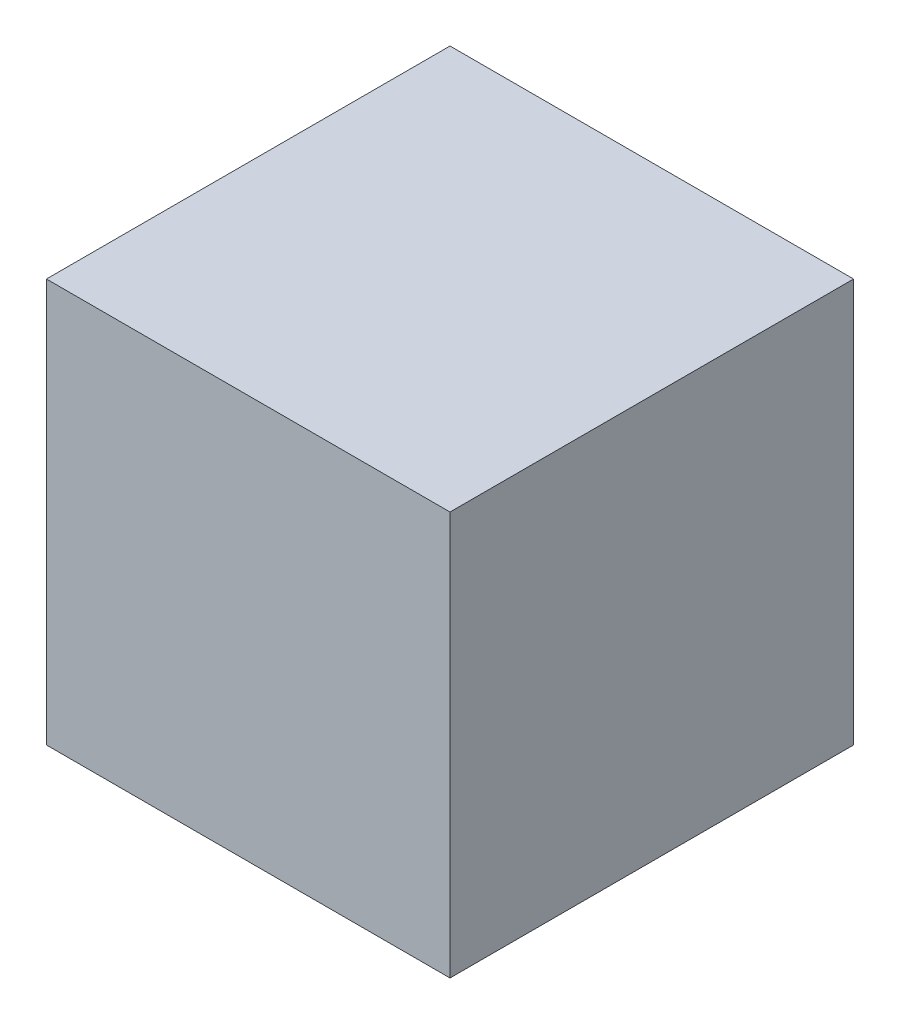
ISO-10303-21;
HEADER;
FILE_DESCRIPTION(('STEP AP214'),'2;1');
FILE_NAME('part.step','',(''),(''),'','','');
FILE_SCHEMA(('AUTOMOTIVE_DESIGN { 1 0 10303 214 1 1 1 1 }'));
ENDSEC;
DATA;
#1=APPLICATION_CONTEXT('core data for automotive mechanical design processes');
#2=APPLICATION_PROTOCOL_DEFINITION('international standard','automotive_design',2000,#1);
#3=PRODUCT_CONTEXT('',#1,'mechanical');
#4=PRODUCT('Part','Part','',(#3));
#5=PRODUCT_RELATED_PRODUCT_CATEGORY('part','',(#4));
#6=PRODUCT_DEFINITION_FORMATION('','',#4);
#7=PRODUCT_DEFINITION_CONTEXT('part definition',#1,'design');
#8=PRODUCT_DEFINITION('design','',#6,#7);
#9=PRODUCT_DEFINITION_SHAPE('','',#8);
#10=(LENGTH_UNIT() NAMED_UNIT(*) SI_UNIT(.MILLI.,.METRE.));
#11=(NAMED_UNIT(*) PLANE_ANGLE_UNIT() SI_UNIT($,.RADIAN.));
#12=(NAMED_UNIT(*) SI_UNIT($,.STERADIAN.) SOLID_ANGLE_UNIT());
#13=UNCERTAINTY_MEASURE_WITH_UNIT(LENGTH_MEASURE(1.E-05),#10,'distance_accuracy_value','');
#14=(GEOMETRIC_REPRESENTATION_CONTEXT(3) GLOBAL_UNCERTAINTY_ASSIGNED_CONTEXT((#13)) GLOBAL_UNIT_ASSIGNED_CONTEXT((#10,
#11,#12)) REPRESENTATION_CONTEXT('',''));
#15=CARTESIAN_POINT('',(0.,0.,0.));
#16=DIRECTION('',(0.,0.,1.));
#17=DIRECTION('',(1.,0.,0.));
#18=AXIS2_PLACEMENT_3D('',#15,#16,#17);
#19=CARTESIAN_POINT('',(15.5,15.37,1.));
#20=DIRECTION('',(0.,1.,0.));
#21=DIRECTION('',(0.,0.,1.));
#22=AXIS2_PLACEMENT_3D('',#19,#20,#21);
#23=PLANE('',#22);
#24=DIRECTION('',(1.,0.,0.));
#25=VECTOR('',#24,1.);
#26=CARTESIAN_POINT('',(15.5,15.37,2.37));
#27=LINE('',#26,#25);
#28=CARTESIAN_POINT('',(16.87,15.37,2.37));
#29=VERTEX_POINT('',#28);
#30=CARTESIAN_POINT('',(15.5,15.37,2.37));
#31=VERTEX_POINT('',#30);
#32=EDGE_CURVE('E76',#29,#31,#27,.F.);
#33=ORIENTED_EDGE('',*,*,#32,.F.);
#34=DIRECTION('',(0.,0.,-1.));
#35=VECTOR('',#34,1.);
#36=CARTESIAN_POINT('',(16.87,15.37,1.));
#37=LINE('',#36,#35);
#38=CARTESIAN_POINT('',(16.87,15.37,1.));
#39=VERTEX_POINT('',#38);
#40=EDGE_CURVE('E58',#39,#29,#37,.F.);
#41=ORIENTED_EDGE('',*,*,#40,.F.);
#42=DIRECTION('',(1.,0.,0.));
#43=VECTOR('',#42,1.);
#44=CARTESIAN_POINT('',(15.5,15.37,1.));
#45=LINE('',#44,#43);
#46=CARTESIAN_POINT('',(15.5,15.37,1.));
#47=VERTEX_POINT('',#46);
#48=EDGE_CURVE('E20',#39,#47,#45,.F.);
#49=ORIENTED_EDGE('',*,*,#48,.T.);
#50=DIRECTION('',(0.,0.,-1.));
#51=VECTOR('',#50,1.);
#52=CARTESIAN_POINT('',(15.5,15.37,1.));
#53=LINE('',#52,#51);
#54=EDGE_CURVE('E55',#47,#31,#53,.F.);
#55=ORIENTED_EDGE('',*,*,#54,.T.);
#56=EDGE_LOOP('',(#33,#41,#49,#55));
#57=FACE_BOUND('',#56,.T.);
#58=ADVANCED_FACE('F17',(#57),#23,.T.);
#59=CARTESIAN_POINT('',(15.5,14.,1.));
#60=DIRECTION('',(0.,0.,1.));
#61=DIRECTION('',(1.,0.,0.));
#62=AXIS2_PLACEMENT_3D('',#59,#60,#61);
#63=PLANE('',#62);
#64=DIRECTION('',(0.,1.,0.));
#65=VECTOR('',#64,1.);
#66=CARTESIAN_POINT('',(16.87,14.,1.));
#67=LINE('',#66,#65);
#68=CARTESIAN_POINT('',(16.87,14.,1.));
#69=VERTEX_POINT('',#68);
#70=EDGE_CURVE('E78',#69,#39,#67,.T.);
#71=ORIENTED_EDGE('',*,*,#70,.F.);
#72=DIRECTION('',(1.,0.,0.));
#73=VECTOR('',#72,1.);
#74=CARTESIAN_POINT('',(15.5,14.,1.));
#75=LINE('',#74,#73);
#76=CARTESIAN_POINT('',(15.5,14.,1.));
#77=VERTEX_POINT('',#76);
#78=EDGE_CURVE('E73',#69,#77,#75,.F.);
#79=ORIENTED_EDGE('',*,*,#78,.T.);
#80=DIRECTION('',(0.,1.,0.));
#81=VECTOR('',#80,1.);
#82=CARTESIAN_POINT('',(15.5,14.,1.));
#83=LINE('',#82,#81);
#84=EDGE_CURVE('E63',#77,#47,#83,.T.);
#85=ORIENTED_EDGE('',*,*,#84,.T.);
#86=ORIENTED_EDGE('',*,*,#48,.F.);
#87=EDGE_LOOP('',(#71,#79,#85,#86));
#88=FACE_BOUND('',#87,.T.);
#89=ADVANCED_FACE('F72',(#88),#63,.F.);
#90=CARTESIAN_POINT('',(15.5,14.,1.));
#91=DIRECTION('',(1.,0.,0.));
#92=DIRECTION('',(0.,0.,-1.));
#93=AXIS2_PLACEMENT_3D('',#90,#91,#92);
#94=PLANE('',#93);
#95=ORIENTED_EDGE('',*,*,#54,.F.);
#96=ORIENTED_EDGE('',*,*,#84,.F.);
#97=DIRECTION('',(0.,0.,1.));
#98=VECTOR('',#97,1.);
#99=CARTESIAN_POINT('',(15.5,14.,1.));
#100=LINE('',#99,#98);
#101=CARTESIAN_POINT('',(15.5,14.,2.37));
#102=VERTEX_POINT('',#101);
#103=EDGE_CURVE('E83',#77,#102,#100,.T.);
#104=ORIENTED_EDGE('',*,*,#103,.T.);
#105=DIRECTION('',(0.,1.,0.));
#106=VECTOR('',#105,1.);
#107=CARTESIAN_POINT('',(15.5,14.,2.37));
#108=LINE('',#107,#106);
#109=EDGE_CURVE('E69',#31,#102,#108,.F.);
#110=ORIENTED_EDGE('',*,*,#109,.F.);
#111=EDGE_LOOP('',(#95,#96,#104,#110));
#112=FACE_BOUND('',#111,.T.);
#113=ADVANCED_FACE('F66',(#112),#94,.F.);
#114=CARTESIAN_POINT('',(15.5,14.,2.37));
#115=DIRECTION('',(0.,0.,1.));
#116=DIRECTION('',(1.,0.,0.));
#117=AXIS2_PLACEMENT_3D('',#114,#115,#116);
#118=PLANE('',#117);
#119=DIRECTION('',(0.,1.,0.));
#120=VECTOR('',#119,1.);
#121=CARTESIAN_POINT('',(16.87,14.,2.37));
#122=LINE('',#121,#120);
#123=CARTESIAN_POINT('',(16.87,14.,2.37));
#124=VERTEX_POINT('',#123);
#125=EDGE_CURVE('E34',#29,#124,#122,.F.);
#126=ORIENTED_EDGE('',*,*,#125,.F.);
#127=ORIENTED_EDGE('',*,*,#32,.T.);
#128=ORIENTED_EDGE('',*,*,#109,.T.);
#129=DIRECTION('',(1.,0.,0.));
#130=VECTOR('',#129,1.);
#131=CARTESIAN_POINT('',(15.5,14.,2.37));
#132=LINE('',#131,#130);
#133=EDGE_CURVE('E26',#102,#124,#132,.T.);
#134=ORIENTED_EDGE('',*,*,#133,.T.);
#135=EDGE_LOOP('',(#126,#127,#128,#134));
#136=FACE_BOUND('',#135,.T.);
#137=ADVANCED_FACE('F88',(#136),#118,.T.);
#138=CARTESIAN_POINT('',(16.87,14.,1.));
#139=DIRECTION('',(1.,0.,0.));
#140=DIRECTION('',(0.,0.,-1.));
#141=AXIS2_PLACEMENT_3D('',#138,#139,#140);
#142=PLANE('',#141);
#143=ORIENTED_EDGE('',*,*,#40,.T.);
#144=ORIENTED_EDGE('',*,*,#125,.T.);
#145=DIRECTION('',(0.,0.,1.));
#146=VECTOR('',#145,1.);
#147=CARTESIAN_POINT('',(16.87,14.,1.));
#148=LINE('',#147,#146);
#149=EDGE_CURVE('E11',#124,#69,#148,.F.);
#150=ORIENTED_EDGE('',*,*,#149,.T.);
#151=ORIENTED_EDGE('',*,*,#70,.T.);
#152=EDGE_LOOP('',(#143,#144,#150,#151));
#153=FACE_BOUND('',#152,.T.);
#154=ADVANCED_FACE('F91',(#153),#142,.T.);
#155=CARTESIAN_POINT('',(15.5,14.,1.));
#156=DIRECTION('',(0.,1.,0.));
#157=DIRECTION('',(0.,0.,1.));
#158=AXIS2_PLACEMENT_3D('',#155,#156,#157);
#159=PLANE('',#158);
#160=ORIENTED_EDGE('',*,*,#133,.F.);
#161=ORIENTED_EDGE('',*,*,#103,.F.);
#162=ORIENTED_EDGE('',*,*,#78,.F.);
#163=ORIENTED_EDGE('',*,*,#149,.F.);
#164=EDGE_LOOP('',(#160,#161,#162,#163));
#165=FACE_BOUND('',#164,.T.);
#166=ADVANCED_FACE('F90',(#165),#159,.F.);
#167=CLOSED_SHELL('',(#58,#89,#113,#137,#154,#166));
#168=MANIFOLD_SOLID_BREP('B1',#167);
#169=ADVANCED_BREP_SHAPE_REPRESENTATION('',(#18,#168),#14);
#170=SHAPE_DEFINITION_REPRESENTATION(#9,#169);
ENDSEC;
END-ISO-10303-21;
